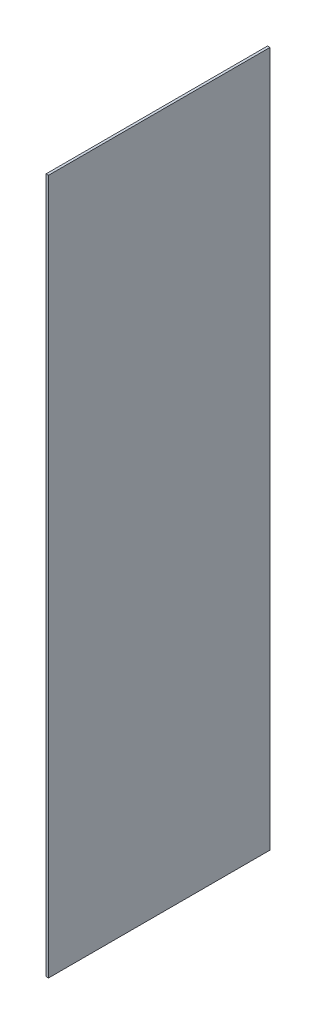
ISO-10303-21;
HEADER;
FILE_DESCRIPTION(('STEP AP214'),'2;1');
FILE_NAME('part.step','',(''),(''),'','','');
FILE_SCHEMA(('AUTOMOTIVE_DESIGN { 1 0 10303 214 1 1 1 1 }'));
ENDSEC;
DATA;
#1=APPLICATION_CONTEXT('core data for automotive mechanical design processes');
#2=APPLICATION_PROTOCOL_DEFINITION('international standard','automotive_design',2000,#1);
#3=PRODUCT_CONTEXT('',#1,'mechanical');
#4=PRODUCT('Part','Part','',(#3));
#5=PRODUCT_RELATED_PRODUCT_CATEGORY('part','',(#4));
#6=PRODUCT_DEFINITION_FORMATION('','',#4);
#7=PRODUCT_DEFINITION_CONTEXT('part definition',#1,'design');
#8=PRODUCT_DEFINITION('design','',#6,#7);
#9=PRODUCT_DEFINITION_SHAPE('','',#8);
#10=(LENGTH_UNIT() NAMED_UNIT(*) SI_UNIT(.MILLI.,.METRE.));
#11=(NAMED_UNIT(*) PLANE_ANGLE_UNIT() SI_UNIT($,.RADIAN.));
#12=(NAMED_UNIT(*) SI_UNIT($,.STERADIAN.) SOLID_ANGLE_UNIT());
#13=UNCERTAINTY_MEASURE_WITH_UNIT(LENGTH_MEASURE(1.E-05),#10,'distance_accuracy_value','');
#14=(GEOMETRIC_REPRESENTATION_CONTEXT(3) GLOBAL_UNCERTAINTY_ASSIGNED_CONTEXT((#13)) GLOBAL_UNIT_ASSIGNED_CONTEXT((#10,
#11,#12)) REPRESENTATION_CONTEXT('',''));
#15=CARTESIAN_POINT('',(0.,0.,0.));
#16=DIRECTION('',(0.,0.,1.));
#17=DIRECTION('',(1.,0.,0.));
#18=AXIS2_PLACEMENT_3D('',#15,#16,#17);
#19=CARTESIAN_POINT('',(-2.6,0.,0.));
#20=DIRECTION('',(0.,1.,0.));
#21=DIRECTION('',(0.,0.,1.));
#22=AXIS2_PLACEMENT_3D('',#19,#20,#21);
#23=PLANE('',#22);
#24=DIRECTION('',(0.,0.,1.));
#25=VECTOR('',#24,1.);
#26=CARTESIAN_POINT('',(0.,0.,0.));
#27=LINE('',#26,#25);
#28=CARTESIAN_POINT('',(0.,0.,0.));
#29=VERTEX_POINT('',#28);
#30=CARTESIAN_POINT('',(0.,0.,232.5));
#31=VERTEX_POINT('',#30);
#32=EDGE_CURVE('E62',#29,#31,#27,.T.);
#33=ORIENTED_EDGE('',*,*,#32,.T.);
#34=DIRECTION('',(1.,0.,0.));
#35=VECTOR('',#34,1.);
#36=CARTESIAN_POINT('',(-2.6,0.,232.5));
#37=LINE('',#36,#35);
#38=CARTESIAN_POINT('',(-2.6,0.,232.5));
#39=VERTEX_POINT('',#38);
#40=EDGE_CURVE('E10',#39,#31,#37,.T.);
#41=ORIENTED_EDGE('',*,*,#40,.F.);
#42=DIRECTION('',(0.,0.,1.));
#43=VECTOR('',#42,1.);
#44=CARTESIAN_POINT('',(-2.6,0.,0.));
#45=LINE('',#44,#43);
#46=CARTESIAN_POINT('',(-2.6,0.,0.));
#47=VERTEX_POINT('',#46);
#48=EDGE_CURVE('E65',#47,#39,#45,.T.);
#49=ORIENTED_EDGE('',*,*,#48,.F.);
#50=DIRECTION('',(1.,0.,0.));
#51=VECTOR('',#50,1.);
#52=CARTESIAN_POINT('',(-2.6,0.,0.));
#53=LINE('',#52,#51);
#54=EDGE_CURVE('E25',#47,#29,#53,.T.);
#55=ORIENTED_EDGE('',*,*,#54,.T.);
#56=EDGE_LOOP('',(#33,#41,#49,#55));
#57=FACE_BOUND('',#56,.T.);
#58=ADVANCED_FACE('F17',(#57),#23,.F.);
#59=CARTESIAN_POINT('',(-2.6,0.,232.5));
#60=DIRECTION('',(0.,0.,-1.));
#61=DIRECTION('',(-1.,0.,0.));
#62=AXIS2_PLACEMENT_3D('',#59,#60,#61);
#63=PLANE('',#62);
#64=DIRECTION('',(0.,1.,0.));
#65=VECTOR('',#64,1.);
#66=CARTESIAN_POINT('',(0.,0.,232.5));
#67=LINE('',#66,#65);
#68=CARTESIAN_POINT('',(0.,730.,232.5));
#69=VERTEX_POINT('',#68);
#70=EDGE_CURVE('E45',#31,#69,#67,.T.);
#71=ORIENTED_EDGE('',*,*,#70,.T.);
#72=DIRECTION('',(1.,0.,0.));
#73=VECTOR('',#72,1.);
#74=CARTESIAN_POINT('',(-2.59999999999995,730.,232.5));
#75=LINE('',#74,#73);
#76=CARTESIAN_POINT('',(-2.59999999999995,730.,232.5));
#77=VERTEX_POINT('',#76);
#78=EDGE_CURVE('E74',#77,#69,#75,.T.);
#79=ORIENTED_EDGE('',*,*,#78,.F.);
#80=DIRECTION('',(0.,1.,0.));
#81=VECTOR('',#80,1.);
#82=CARTESIAN_POINT('',(-2.6,0.,232.5));
#83=LINE('',#82,#81);
#84=EDGE_CURVE('E83',#39,#77,#83,.T.);
#85=ORIENTED_EDGE('',*,*,#84,.F.);
#86=ORIENTED_EDGE('',*,*,#40,.T.);
#87=EDGE_LOOP('',(#71,#79,#85,#86));
#88=FACE_BOUND('',#87,.T.);
#89=ADVANCED_FACE('F95',(#88),#63,.F.);
#90=CARTESIAN_POINT('',(-2.6,525.,0.));
#91=DIRECTION('',(0.,0.,1.));
#92=DIRECTION('',(0.,-1.,0.));
#93=AXIS2_PLACEMENT_3D('',#90,#91,#92);
#94=PLANE('',#93);
#95=DIRECTION('',(0.,-1.,0.));
#96=VECTOR('',#95,1.);
#97=CARTESIAN_POINT('',(0.,525.,0.));
#98=LINE('',#97,#96);
#99=CARTESIAN_POINT('',(0.,730.,0.));
#100=VERTEX_POINT('',#99);
#101=EDGE_CURVE('E57',#100,#29,#98,.T.);
#102=ORIENTED_EDGE('',*,*,#101,.T.);
#103=ORIENTED_EDGE('',*,*,#54,.F.);
#104=DIRECTION('',(0.,-1.,0.));
#105=VECTOR('',#104,1.);
#106=CARTESIAN_POINT('',(-2.6,525.,0.));
#107=LINE('',#106,#105);
#108=CARTESIAN_POINT('',(-2.59999999999995,730.,0.));
#109=VERTEX_POINT('',#108);
#110=EDGE_CURVE('E33',#109,#47,#107,.T.);
#111=ORIENTED_EDGE('',*,*,#110,.F.);
#112=DIRECTION('',(1.,0.,0.));
#113=VECTOR('',#112,1.);
#114=CARTESIAN_POINT('',(-2.59999999999995,730.,0.));
#115=LINE('',#114,#113);
#116=EDGE_CURVE('E72',#109,#100,#115,.T.);
#117=ORIENTED_EDGE('',*,*,#116,.T.);
#118=EDGE_LOOP('',(#102,#103,#111,#117));
#119=FACE_BOUND('',#118,.T.);
#120=ADVANCED_FACE('F78',(#119),#94,.F.);
#121=CARTESIAN_POINT('',(-2.6,0.,232.5));
#122=DIRECTION('',(-1.,0.,0.));
#123=DIRECTION('',(0.,-1.,0.));
#124=AXIS2_PLACEMENT_3D('',#121,#122,#123);
#125=PLANE('',#124);
#126=ORIENTED_EDGE('',*,*,#48,.T.);
#127=ORIENTED_EDGE('',*,*,#84,.T.);
#128=DIRECTION('',(0.,0.,-1.));
#129=VECTOR('',#128,1.);
#130=CARTESIAN_POINT('',(-2.59999999999995,730.,232.5));
#131=LINE('',#130,#129);
#132=EDGE_CURVE('E76',#77,#109,#131,.T.);
#133=ORIENTED_EDGE('',*,*,#132,.T.);
#134=ORIENTED_EDGE('',*,*,#110,.T.);
#135=EDGE_LOOP('',(#126,#127,#133,#134));
#136=FACE_BOUND('',#135,.T.);
#137=ADVANCED_FACE('F93',(#136),#125,.T.);
#138=CARTESIAN_POINT('',(0.,0.,232.5));
#139=DIRECTION('',(-1.,0.,0.));
#140=DIRECTION('',(0.,-1.,0.));
#141=AXIS2_PLACEMENT_3D('',#138,#139,#140);
#142=PLANE('',#141);
#143=ORIENTED_EDGE('',*,*,#32,.F.);
#144=ORIENTED_EDGE('',*,*,#101,.F.);
#145=DIRECTION('',(0.,0.,-1.));
#146=VECTOR('',#145,1.);
#147=CARTESIAN_POINT('',(0.,730.,232.5));
#148=LINE('',#147,#146);
#149=EDGE_CURVE('E60',#69,#100,#148,.T.);
#150=ORIENTED_EDGE('',*,*,#149,.F.);
#151=ORIENTED_EDGE('',*,*,#70,.F.);
#152=EDGE_LOOP('',(#143,#144,#150,#151));
#153=FACE_BOUND('',#152,.T.);
#154=ADVANCED_FACE('F59',(#153),#142,.F.);
#155=CARTESIAN_POINT('',(-2.59999999999995,730.,232.5));
#156=DIRECTION('',(0.,-1.,0.));
#157=DIRECTION('',(0.,0.,-1.));
#158=AXIS2_PLACEMENT_3D('',#155,#156,#157);
#159=PLANE('',#158);
#160=ORIENTED_EDGE('',*,*,#149,.T.);
#161=ORIENTED_EDGE('',*,*,#116,.F.);
#162=ORIENTED_EDGE('',*,*,#132,.F.);
#163=ORIENTED_EDGE('',*,*,#78,.T.);
#164=EDGE_LOOP('',(#160,#161,#162,#163));
#165=FACE_BOUND('',#164,.T.);
#166=ADVANCED_FACE('F70',(#165),#159,.F.);
#167=CLOSED_SHELL('',(#58,#89,#120,#137,#154,#166));
#168=MANIFOLD_SOLID_BREP('B1',#167);
#169=ADVANCED_BREP_SHAPE_REPRESENTATION('',(#18,#168),#14);
#170=SHAPE_DEFINITION_REPRESENTATION(#9,#169);
ENDSEC;
END-ISO-10303-21;
